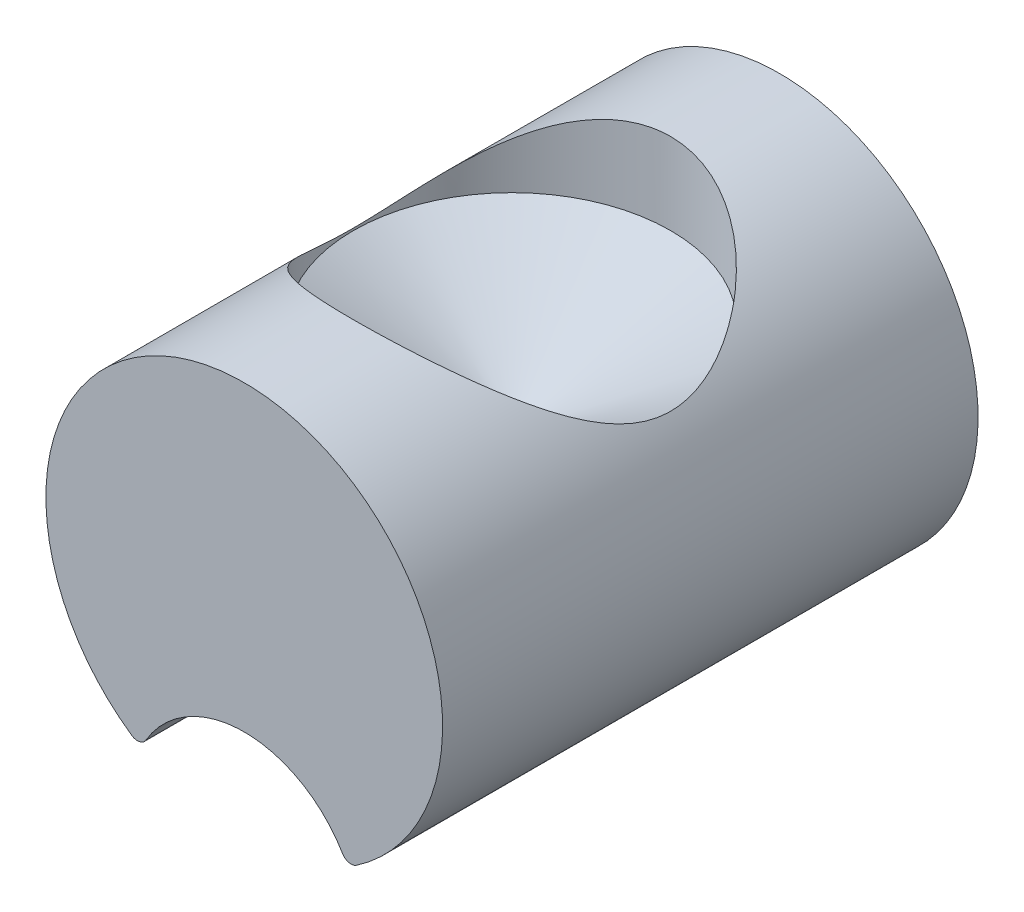
ISO-10303-21;
HEADER;
FILE_DESCRIPTION(('STEP AP214'),'2;1');
FILE_NAME('part.step','',(''),(''),'','','');
FILE_SCHEMA(('AUTOMOTIVE_DESIGN { 1 0 10303 214 1 1 1 1 }'));
ENDSEC;
DATA;
#1=APPLICATION_CONTEXT('core data for automotive mechanical design processes');
#2=APPLICATION_PROTOCOL_DEFINITION('international standard','automotive_design',2000,#1);
#3=PRODUCT_CONTEXT('',#1,'mechanical');
#4=PRODUCT('Part','Part','',(#3));
#5=PRODUCT_RELATED_PRODUCT_CATEGORY('part','',(#4));
#6=PRODUCT_DEFINITION_FORMATION('','',#4);
#7=PRODUCT_DEFINITION_CONTEXT('part definition',#1,'design');
#8=PRODUCT_DEFINITION('design','',#6,#7);
#9=PRODUCT_DEFINITION_SHAPE('','',#8);
#10=(LENGTH_UNIT() NAMED_UNIT(*) SI_UNIT(.MILLI.,.METRE.));
#11=(NAMED_UNIT(*) PLANE_ANGLE_UNIT() SI_UNIT($,.RADIAN.));
#12=(NAMED_UNIT(*) SI_UNIT($,.STERADIAN.) SOLID_ANGLE_UNIT());
#13=UNCERTAINTY_MEASURE_WITH_UNIT(LENGTH_MEASURE(1.E-05),#10,'distance_accuracy_value','');
#14=(GEOMETRIC_REPRESENTATION_CONTEXT(3) GLOBAL_UNCERTAINTY_ASSIGNED_CONTEXT((#13)) GLOBAL_UNIT_ASSIGNED_CONTEXT((#10,
#11,#12)) REPRESENTATION_CONTEXT('',''));
#15=CARTESIAN_POINT('',(0.,0.,0.));
#16=DIRECTION('',(0.,0.,1.));
#17=DIRECTION('',(1.,0.,0.));
#18=AXIS2_PLACEMENT_3D('',#15,#16,#17);
#19=CARTESIAN_POINT('',(-5.26281506662476E-13,3.37799999999972,18.2));
#20=DIRECTION('',(0.,1.,0.));
#21=DIRECTION('',(0.,0.,-1.));
#22=AXIS2_PLACEMENT_3D('',#19,#20,#21);
#23=CONICAL_SURFACE('',#22,1.6,1.0297442575);
#24=CARTESIAN_POINT('',(-5.26281506662476E-13,2.41662300955562,18.2));
#25=VERTEX_POINT('',#24);
#26=VERTEX_LOOP('',#25);
#27=FACE_BOUND('',#26,.T.);
#28=CARTESIAN_POINT('',(-5.26281506662476E-13,3.37799999999972,18.2));
#29=DIRECTION('',(0.,1.,0.));
#30=DIRECTION('',(0.,0.,-1.));
#31=AXIS2_PLACEMENT_3D('',#28,#29,#30);
#32=CIRCLE('',#31,1.6);
#33=CARTESIAN_POINT('',(-5.26281506662476E-13,3.37799999999972,16.6));
#34=VERTEX_POINT('',#33);
#35=EDGE_CURVE('E11',#34,#34,#32,.T.);
#36=ORIENTED_EDGE('',*,*,#35,.T.);
#37=EDGE_LOOP('',(#36));
#38=FACE_BOUND('',#37,.T.);
#39=ADVANCED_FACE('F16',(#27,#38),#23,.F.);
#40=CARTESIAN_POINT('',(-5.26281506662476E-13,4.93799999999972,18.2));
#41=DIRECTION('',(0.,-1.,0.));
#42=DIRECTION('',(0.,0.,1.));
#43=AXIS2_PLACEMENT_3D('',#40,#41,#42);
#44=CYLINDRICAL_SURFACE('',#43,1.6);
#45=CARTESIAN_POINT('',(-5.27084791991687E-13,4.19999999999972,16.6));
#46=CARTESIAN_POINT('',(0.0767976368470905,4.19999419000825,16.6000059855871));
#47=CARTESIAN_POINT('',(0.153706586471599,4.19553096618282,16.6055755220236));
#48=CARTESIAN_POINT('',(0.305055460209918,4.17807413595488,16.6274799729869));
#49=CARTESIAN_POINT('',(0.379489538855417,4.16506165894188,16.6438387026115));
#50=CARTESIAN_POINT('',(0.523275942005946,4.13173377955005,16.6861426175494));
#51=CARTESIAN_POINT('',(0.592657360814673,4.11146496251388,16.7120266796388));
#52=CARTESIAN_POINT('',(0.725541056640739,4.06508808661169,16.7720938762882));
#53=CARTESIAN_POINT('',(0.789043315032508,4.0389800092474,16.8062770371391));
#54=CARTESIAN_POINT('',(0.930544990202431,3.97260531838992,16.8949026914065));
#55=CARTESIAN_POINT('',(1.00589414387122,3.93057398897539,16.9522551319733));
#56=CARTESIAN_POINT('',(1.14433094236697,3.84233754067356,17.0778224527581));
#57=CARTESIAN_POINT('',(1.20738209219582,3.79612057756323,17.1460686028476));
#58=CARTESIAN_POINT('',(1.32172735171376,3.70284801307957,17.2934191872126));
#59=CARTESIAN_POINT('',(1.37282110767562,3.65579064722676,17.3726774183689));
#60=CARTESIAN_POINT('',(1.46117467528999,3.56705687905286,17.5412310260153));
#61=CARTESIAN_POINT('',(1.49848079508703,3.52536277671092,17.6304914671128));
#62=CARTESIAN_POINT('',(1.54468835017612,3.47068521840838,17.7791031613402));
#63=CARTESIAN_POINT('',(1.5589238065653,3.45302982216156,17.8350493903839));
#64=CARTESIAN_POINT('',(1.58138717438556,3.42455911324605,17.9497701472967));
#65=CARTESIAN_POINT('',(1.58962985505353,3.41372699343755,18.0085373388201));
#66=CARTESIAN_POINT('',(1.59951872114006,3.40067387248863,18.1281540150967));
#67=CARTESIAN_POINT('',(1.6011067649069,3.39852877541219,18.1890171878566));
#68=CARTESIAN_POINT('',(1.59735585359692,3.40351969842217,18.3101639136262));
#69=CARTESIAN_POINT('',(1.59201103608816,3.41066357328164,18.370446932613));
#70=CARTESIAN_POINT('',(1.57356242169501,3.43456577039948,18.4977778420902));
#71=CARTESIAN_POINT('',(1.55937446564444,3.45265473639594,18.5644064048432));
#72=CARTESIAN_POINT('',(1.52355637879026,3.49597967948995,18.6932284476296));
#73=CARTESIAN_POINT('',(1.5019042051375,3.52123678558887,18.7554081252319));
#74=CARTESIAN_POINT('',(1.43979281755207,3.589248929275,18.9045296848327));
#75=CARTESIAN_POINT('',(1.39531909276338,3.63450698374476,18.9886421586431));
#76=CARTESIAN_POINT('',(1.2931077399799,3.7273102404854,19.1469733422397));
#77=CARTESIAN_POINT('',(1.23535077521966,3.77485869639193,19.2211773766759));
#78=CARTESIAN_POINT('',(1.10516654661017,3.86890201574656,19.361019817123));
#79=CARTESIAN_POINT('',(1.0323896082134,3.91533511408317,19.4263775378406));
#80=CARTESIAN_POINT('',(0.873587928582628,4.00137497196244,19.5440795995515));
#81=CARTESIAN_POINT('',(0.787599716167108,4.04099993458964,19.5964588129089));
#82=CARTESIAN_POINT('',(0.630222251499117,4.0993966851389,19.6724502779172));
#83=CARTESIAN_POINT('',(0.561742181847276,4.1208885697693,19.7000036035165));
#84=CARTESIAN_POINT('',(0.419931139004773,4.15678051291481,19.7457011608251));
#85=CARTESIAN_POINT('',(0.346603869074737,4.1711859160627,19.7638524840845));
#86=CARTESIAN_POINT('',(0.196570587017711,4.19176268539323,19.7897108374199));
#87=CARTESIAN_POINT('',(0.119849045553832,4.19789102873962,19.7973632993147));
#88=CARTESIAN_POINT('',(-0.0340864020788171,4.201189461944,19.8014872396622));
#89=CARTESIAN_POINT('',(-0.111300213857823,4.19836122050146,19.7979608008536));
#90=CARTESIAN_POINT('',(-0.257397340064712,4.18461486801364,19.7807337453514));
#91=CARTESIAN_POINT('',(-0.326448716063022,4.17437081518286,19.7678806539609));
#92=CARTESIAN_POINT('',(-0.461068536725445,4.14734010976608,19.7337022610484));
#93=CARTESIAN_POINT('',(-0.526635941192577,4.13055151553361,19.7123744451933));
#94=CARTESIAN_POINT('',(-0.65698871254499,4.09031877940972,19.6606796791373));
#95=CARTESIAN_POINT('',(-0.721474935859565,4.06652724032422,19.6298352812798));
#96=CARTESIAN_POINT('',(-0.844327963261343,4.01426904335036,19.5609103686534));
#97=CARTESIAN_POINT('',(-0.902694461949918,3.98580215232509,19.522829493022));
#98=CARTESIAN_POINT('',(-1.02340207988104,3.91994922636384,19.4326201453155));
#99=CARTESIAN_POINT('',(-1.08440647995508,3.88189464636411,19.379197023288));
#100=CARTESIAN_POINT('',(-1.19722877053734,3.80354909862494,19.2644920599446));
#101=CARTESIAN_POINT('',(-1.24901947697589,3.7632519590316,19.2031878537798));
#102=CARTESIAN_POINT('',(-1.32454956976621,3.69899053823284,19.0988487281527));
#103=CARTESIAN_POINT('',(-1.35131502101245,3.67483018264318,19.0581001799525));
#104=CARTESIAN_POINT('',(-1.40123492600634,3.62749109511304,18.973913544302));
#105=CARTESIAN_POINT('',(-1.42438746422058,3.60431288861077,18.9304740470699));
#106=CARTESIAN_POINT('',(-1.48801422824989,3.53772934048831,18.7962976942889));
#107=CARTESIAN_POINT('',(-1.52297847709079,3.49698608203036,18.7012662463946));
#108=CARTESIAN_POINT('',(-1.56288668713074,3.44815705008172,18.5471054495846));
#109=CARTESIAN_POINT('',(-1.57423790645953,3.43367818503148,18.4916551061344));
#110=CARTESIAN_POINT('',(-1.59102981991815,3.41194652258059,18.3785366545811));
#111=CARTESIAN_POINT('',(-1.59648542455066,3.40467549981686,18.3208745249616));
#112=CARTESIAN_POINT('',(-1.60105683170655,3.3985980135151,18.2045191241375));
#113=CARTESIAN_POINT('',(-1.60013856968378,3.39983703073579,18.145821987378));
#114=CARTESIAN_POINT('',(-1.59197214489107,3.41064615014199,18.0296134962271));
#115=CARTESIAN_POINT('',(-1.58471394646472,3.42022946065806,17.9721041698607));
#116=CARTESIAN_POINT('',(-1.56166156176563,3.44965658107,17.8443126846951));
#117=CARTESIAN_POINT('',(-1.54407198583931,3.47159387930752,17.7748542919226));
#118=CARTESIAN_POINT('',(-1.50086728067805,3.52231144974372,17.6411004806072));
#119=CARTESIAN_POINT('',(-1.47522850848378,3.55111182005334,17.5768209821935));
#120=CARTESIAN_POINT('',(-1.40352819910707,3.62613786222745,17.4254207221873));
#121=CARTESIAN_POINT('',(-1.35347873071268,3.67434010695962,17.3411721242731));
#122=CARTESIAN_POINT('',(-1.23929576768424,3.77156213737812,17.1833225078533));
#123=CARTESIAN_POINT('',(-1.17514630739205,3.82058279114657,17.109733717612));
#124=CARTESIAN_POINT('',(-1.03205632389772,3.91532159024097,16.9733161171493));
#125=CARTESIAN_POINT('',(-0.95293405756863,3.96098841359844,16.9106399135087));
#126=CARTESIAN_POINT('',(-0.781109564793398,4.0436049187613,16.799919039995));
#127=CARTESIAN_POINT('',(-0.68844861561848,4.08058023602147,16.751831216834));
#128=CARTESIAN_POINT('',(-0.524002571143398,4.13138349590783,16.6865579627067));
#129=CARTESIAN_POINT('',(-0.455281020047061,4.14882736287868,16.6644091916243));
#130=CARTESIAN_POINT('',(-0.314177630665551,4.17646671115886,16.6294785199133));
#131=CARTESIAN_POINT('',(-0.24180591748208,4.18668117635539,16.6166720842458));
#132=CARTESIAN_POINT('',(-0.140704325282921,4.19524327327864,16.6059493063584));
#133=CARTESIAN_POINT('',(-0.112646726395578,4.19702341828024,16.6037220215416));
#134=CARTESIAN_POINT('',(-0.0563977758017473,4.19940297995467,16.6007461046566));
#135=CARTESIAN_POINT('',(-0.0282063957323051,4.20000213390546,16.5999978016011));
#136=CARTESIAN_POINT('',(-5.27084791991687E-13,4.19999999999972,16.6));
#137=B_SPLINE_CURVE_WITH_KNOTS('',3,(#45,#46,#47,#48,#49,#50,#51,#52,#53,#54,#55,#56,#57,#58,
#59,#60,#61,#62,#63,#64,#65,#66,#67,#68,#69,#70,#71,#72,#73,#74,#75,#76,#77,#78,#79,#80,#81,#82,
#83,#84,#85,#86,#87,#88,#89,#90,#91,#92,#93,#94,#95,#96,#97,#98,#99,#100,#101,#102,#103,#104,
#105,#106,#107,#108,#109,#110,#111,#112,#113,#114,#115,#116,#117,#118,#119,#120,#121,#122,#123,
#124,#125,#126,#127,#128,#129,#130,#131,#132,#133,#134,#135,#136),.UNSPECIFIED.,.T.,.F.,(4,2,2,
2,2,2,2,2,2,2,2,2,2,2,2,2,2,2,2,2,2,2,2,2,2,2,2,2,2,2,2,2,2,2,2,2,2,2,2,2,2,2,2,2,2,4),(0.,
0.230269284793767,0.461048554111474,0.690372045800484,0.919696263976645,1.22886310560081,
1.53893390550281,1.85387793412385,2.16775434340101,2.34827589072904,2.52835101926488,
2.70999622800607,2.89179513623058,3.10206904025608,3.31296930796564,3.6274059855064,
3.94230332709338,4.26558538630734,4.5879891523254,4.8177118249984,5.04726097391093,
5.2779987491197,5.50869353815016,5.72069603950526,5.93276148607657,6.15794202441251,
6.38313379481078,6.65092429799458,6.9194922397672,7.08253248596723,7.24565888304679,
7.57008945275799,7.7447464082461,7.91896060039081,8.09410657847875,8.26953030330823,
8.49307578333016,8.71728412727918,9.04323926867124,9.36956541357018,9.70014127323084,
10.0297295148858,10.2516935181631,10.4730724754656,10.5576274492497,10.6422012309228),.UNSPECIFIED.);
#138=CARTESIAN_POINT('',(-5.27084791991687E-13,4.19999999999972,16.6));
#139=VERTEX_POINT('',#138);
#140=EDGE_CURVE('E21',#139,#139,#137,.T.);
#141=ORIENTED_EDGE('',*,*,#140,.F.);
#142=EDGE_LOOP('',(#141));
#143=FACE_BOUND('',#142,.T.);
#144=ORIENTED_EDGE('',*,*,#35,.F.);
#145=EDGE_LOOP('',(#144));
#146=FACE_BOUND('',#145,.T.);
#147=ADVANCED_FACE('F18',(#143,#146),#44,.F.);
#148=CARTESIAN_POINT('',(1.07689732023313,0.634659090908809,20.9));
#149=DIRECTION('',(0.,0.,-1.));
#150=DIRECTION('',(1.,0.,0.));
#151=AXIS2_PLACEMENT_3D('',#148,#149,#150);
#152=CYLINDRICAL_SURFACE('',#151,0.1);
#153=CARTESIAN_POINT('',(1.07689732023313,0.634659090908809,15.5));
#154=DIRECTION('',(0.,0.,-1.));
#155=DIRECTION('',(1.,0.,0.));
#156=AXIS2_PLACEMENT_3D('',#153,#154,#155);
#157=CIRCLE('',#156,0.1);
#158=CARTESIAN_POINT('',(1.13357612656122,0.552272727272449,15.5));
#159=VERTEX_POINT('',#158);
#160=CARTESIAN_POINT('',(0.990745534614445,0.58388636363608,15.5));
#161=VERTEX_POINT('',#160);
#162=EDGE_CURVE('E32',#159,#161,#157,.T.);
#163=ORIENTED_EDGE('',*,*,#162,.F.);
#164=DIRECTION('',(0.,0.,-1.));
#165=VECTOR('',#164,1.);
#166=CARTESIAN_POINT('',(1.13357612656122,0.552272727272449,20.9));
#167=LINE('',#166,#165);
#168=CARTESIAN_POINT('',(1.13357612656122,0.552272727272449,20.9));
#169=VERTEX_POINT('',#168);
#170=EDGE_CURVE('E99',#169,#159,#167,.T.);
#171=ORIENTED_EDGE('',*,*,#170,.F.);
#172=CARTESIAN_POINT('',(1.07689732023313,0.634659090908809,20.9));
#173=DIRECTION('',(0.,0.,1.));
#174=DIRECTION('',(1.,0.,0.));
#175=AXIS2_PLACEMENT_3D('',#172,#173,#174);
#176=CIRCLE('',#175,0.1);
#177=CARTESIAN_POINT('',(0.990745534614445,0.58388636363608,20.9));
#178=VERTEX_POINT('',#177);
#179=EDGE_CURVE('E129',#178,#169,#176,.T.);
#180=ORIENTED_EDGE('',*,*,#179,.F.);
#181=DIRECTION('',(0.,0.,1.));
#182=VECTOR('',#181,1.);
#183=CARTESIAN_POINT('',(0.990745534614445,0.58388636363608,20.9));
#184=LINE('',#183,#182);
#185=EDGE_CURVE('E102',#161,#178,#184,.T.);
#186=ORIENTED_EDGE('',*,*,#185,.F.);
#187=EDGE_LOOP('',(#163,#171,#180,#186));
#188=FACE_BOUND('',#187,.T.);
#189=ADVANCED_FACE('F98',(#188),#152,.T.);
#190=CARTESIAN_POINT('',(-1.07689732023419,0.634659090908809,20.9));
#191=DIRECTION('',(0.,0.,1.));
#192=DIRECTION('',(-1.,0.,0.));
#193=AXIS2_PLACEMENT_3D('',#190,#191,#192);
#194=CYLINDRICAL_SURFACE('',#193,0.1);
#195=CARTESIAN_POINT('',(-1.07689732023419,0.634659090908809,20.9));
#196=DIRECTION('',(0.,0.,1.));
#197=DIRECTION('',(1.,0.,0.));
#198=AXIS2_PLACEMENT_3D('',#195,#196,#197);
#199=CIRCLE('',#198,0.1);
#200=CARTESIAN_POINT('',(-1.13357612656228,0.552272727272449,20.9));
#201=VERTEX_POINT('',#200);
#202=CARTESIAN_POINT('',(-0.990745534615496,0.58388636363608,20.9));
#203=VERTEX_POINT('',#202);
#204=EDGE_CURVE('E70',#201,#203,#199,.T.);
#205=ORIENTED_EDGE('',*,*,#204,.F.);
#206=DIRECTION('',(0.,0.,1.));
#207=VECTOR('',#206,1.);
#208=CARTESIAN_POINT('',(-1.13357612656228,0.552272727272449,20.9));
#209=LINE('',#208,#207);
#210=CARTESIAN_POINT('',(-1.13357612656228,0.552272727272449,15.5));
#211=VERTEX_POINT('',#210);
#212=EDGE_CURVE('E117',#211,#201,#209,.T.);
#213=ORIENTED_EDGE('',*,*,#212,.F.);
#214=CARTESIAN_POINT('',(-1.07689732023419,0.634659090908809,15.5));
#215=DIRECTION('',(0.,0.,-1.));
#216=DIRECTION('',(1.,0.,0.));
#217=AXIS2_PLACEMENT_3D('',#214,#215,#216);
#218=CIRCLE('',#217,0.1);
#219=CARTESIAN_POINT('',(-0.990745534615496,0.58388636363608,15.5));
#220=VERTEX_POINT('',#219);
#221=EDGE_CURVE('E105',#220,#211,#218,.T.);
#222=ORIENTED_EDGE('',*,*,#221,.F.);
#223=DIRECTION('',(0.,0.,-1.));
#224=VECTOR('',#223,1.);
#225=CARTESIAN_POINT('',(-0.990745534615496,0.58388636363608,20.9));
#226=LINE('',#225,#224);
#227=EDGE_CURVE('E203',#203,#220,#226,.T.);
#228=ORIENTED_EDGE('',*,*,#227,.F.);
#229=EDGE_LOOP('',(#205,#213,#222,#228));
#230=FACE_BOUND('',#229,.T.);
#231=ADVANCED_FACE('F168',(#230),#194,.T.);
#232=CARTESIAN_POINT('',(-5.26107981852796E-13,1.09999999999972,15.5));
#233=DIRECTION('',(0.,0.,1.));
#234=DIRECTION('',(1.,0.,0.));
#235=AXIS2_PLACEMENT_3D('',#232,#233,#234);
#236=PLANE('',#235);
#237=CARTESIAN_POINT('',(-5.25934457043116E-13,-2.80591522239249E-13,15.5));
#238=DIRECTION('',(0.,0.,-1.));
#239=DIRECTION('',(1.,0.,0.));
#240=AXIS2_PLACEMENT_3D('',#237,#238,#239);
#241=CIRCLE('',#240,1.15);
#242=EDGE_CURVE('E206',#220,#161,#241,.T.);
#243=ORIENTED_EDGE('',*,*,#242,.F.);
#244=ORIENTED_EDGE('',*,*,#221,.T.);
#245=CARTESIAN_POINT('',(-5.26281506662476E-13,2.19999999999972,15.5));
#246=DIRECTION('',(0.,0.,1.));
#247=DIRECTION('',(1.,0.,0.));
#248=AXIS2_PLACEMENT_3D('',#245,#246,#247);
#249=CIRCLE('',#248,2.);
#250=EDGE_CURVE('E110',#159,#211,#249,.T.);
#251=ORIENTED_EDGE('',*,*,#250,.F.);
#252=ORIENTED_EDGE('',*,*,#162,.T.);
#253=EDGE_LOOP('',(#243,#244,#251,#252));
#254=FACE_BOUND('',#253,.T.);
#255=ADVANCED_FACE('F114',(#254),#236,.F.);
#256=CARTESIAN_POINT('',(-5.26107981852796E-13,1.09999999999972,20.9));
#257=DIRECTION('',(0.,0.,1.));
#258=DIRECTION('',(1.,0.,0.));
#259=AXIS2_PLACEMENT_3D('',#256,#257,#258);
#260=PLANE('',#259);
#261=CARTESIAN_POINT('',(-5.26281506662476E-13,2.19999999999972,20.9));
#262=DIRECTION('',(0.,0.,1.));
#263=DIRECTION('',(1.,0.,0.));
#264=AXIS2_PLACEMENT_3D('',#261,#262,#263);
#265=CIRCLE('',#264,2.);
#266=EDGE_CURVE('E111',#169,#201,#265,.T.);
#267=ORIENTED_EDGE('',*,*,#266,.T.);
#268=ORIENTED_EDGE('',*,*,#204,.T.);
#269=CARTESIAN_POINT('',(-5.25934457043116E-13,-2.80591522239249E-13,20.9));
#270=DIRECTION('',(0.,0.,-1.));
#271=DIRECTION('',(1.,0.,0.));
#272=AXIS2_PLACEMENT_3D('',#269,#270,#271);
#273=CIRCLE('',#272,1.15);
#274=EDGE_CURVE('E205',#203,#178,#273,.T.);
#275=ORIENTED_EDGE('',*,*,#274,.T.);
#276=ORIENTED_EDGE('',*,*,#179,.T.);
#277=EDGE_LOOP('',(#267,#268,#275,#276));
#278=FACE_BOUND('',#277,.T.);
#279=ADVANCED_FACE('F154',(#278),#260,.T.);
#280=CARTESIAN_POINT('',(-5.26281506662476E-13,2.19999999999972,20.9));
#281=DIRECTION('',(0.,0.,-1.));
#282=DIRECTION('',(1.,0.,0.));
#283=AXIS2_PLACEMENT_3D('',#280,#281,#282);
#284=CYLINDRICAL_SURFACE('',#283,2.);
#285=ORIENTED_EDGE('',*,*,#250,.T.);
#286=ORIENTED_EDGE('',*,*,#212,.T.);
#287=ORIENTED_EDGE('',*,*,#266,.F.);
#288=ORIENTED_EDGE('',*,*,#170,.T.);
#289=EDGE_LOOP('',(#285,#286,#287,#288));
#290=FACE_BOUND('',#289,.T.);
#291=ORIENTED_EDGE('',*,*,#140,.T.);
#292=EDGE_LOOP('',(#291));
#293=FACE_BOUND('',#292,.T.);
#294=ADVANCED_FACE('F108',(#290,#293),#284,.T.);
#295=CARTESIAN_POINT('',(-5.25934457043116E-13,-2.80591522239249E-13,20.9));
#296=DIRECTION('',(0.,0.,-1.));
#297=DIRECTION('',(1.,0.,0.));
#298=AXIS2_PLACEMENT_3D('',#295,#296,#297);
#299=CYLINDRICAL_SURFACE('',#298,1.15);
#300=ORIENTED_EDGE('',*,*,#274,.F.);
#301=ORIENTED_EDGE('',*,*,#227,.T.);
#302=ORIENTED_EDGE('',*,*,#242,.T.);
#303=ORIENTED_EDGE('',*,*,#185,.T.);
#304=EDGE_LOOP('',(#300,#301,#302,#303));
#305=FACE_BOUND('',#304,.T.);
#306=ADVANCED_FACE('F140',(#305),#299,.F.);
#307=CLOSED_SHELL('',(#39,#147,#189,#231,#255,#279,#294,#306));
#308=MANIFOLD_SOLID_BREP('B1',#307);
#309=ADVANCED_BREP_SHAPE_REPRESENTATION('',(#18,#308),#14);
#310=SHAPE_DEFINITION_REPRESENTATION(#9,#309);
ENDSEC;
END-ISO-10303-21;
